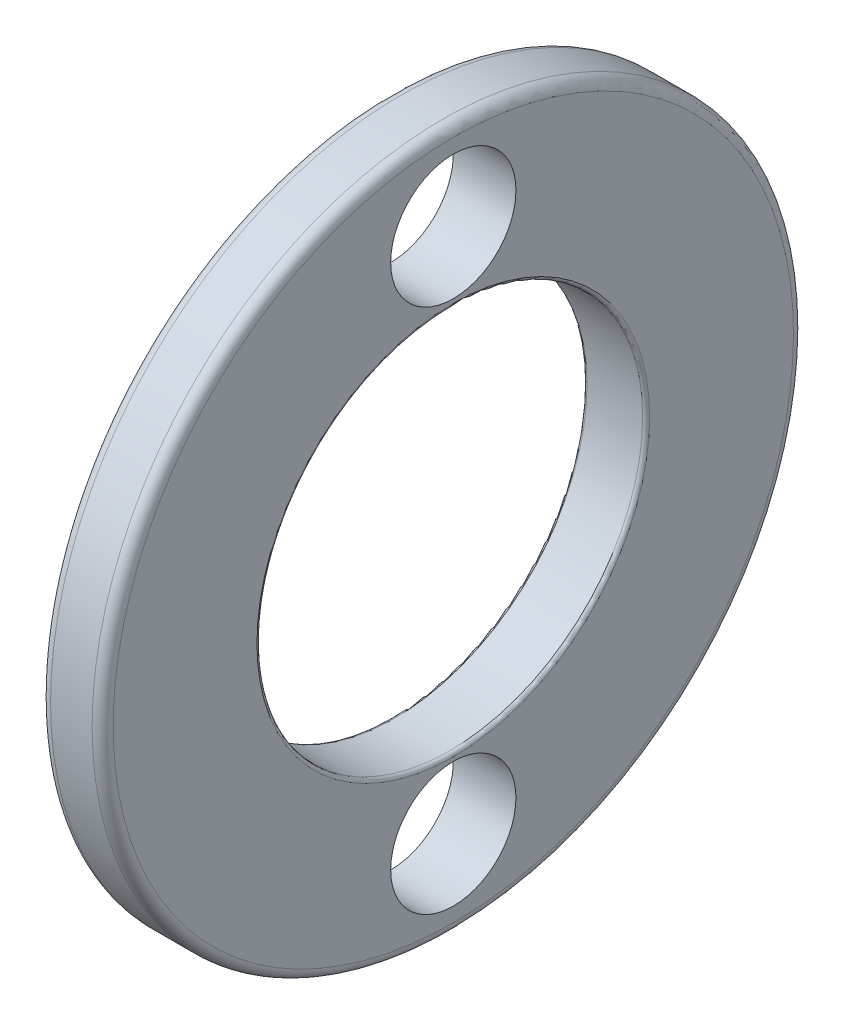
ISO-10303-21;
HEADER;
FILE_DESCRIPTION(('STEP AP214'),'2;1');
FILE_NAME('part.step','',(''),(''),'','','');
FILE_SCHEMA(('AUTOMOTIVE_DESIGN { 1 0 10303 214 1 1 1 1 }'));
ENDSEC;
DATA;
#1=APPLICATION_CONTEXT('core data for automotive mechanical design processes');
#2=APPLICATION_PROTOCOL_DEFINITION('international standard','automotive_design',2000,#1);
#3=PRODUCT_CONTEXT('',#1,'mechanical');
#4=PRODUCT('Part','Part','',(#3));
#5=PRODUCT_RELATED_PRODUCT_CATEGORY('part','',(#4));
#6=PRODUCT_DEFINITION_FORMATION('','',#4);
#7=PRODUCT_DEFINITION_CONTEXT('part definition',#1,'design');
#8=PRODUCT_DEFINITION('design','',#6,#7);
#9=PRODUCT_DEFINITION_SHAPE('','',#8);
#10=(LENGTH_UNIT() NAMED_UNIT(*) SI_UNIT(.MILLI.,.METRE.));
#11=(NAMED_UNIT(*) PLANE_ANGLE_UNIT() SI_UNIT($,.RADIAN.));
#12=(NAMED_UNIT(*) SI_UNIT($,.STERADIAN.) SOLID_ANGLE_UNIT());
#13=UNCERTAINTY_MEASURE_WITH_UNIT(LENGTH_MEASURE(1.E-05),#10,'distance_accuracy_value','');
#14=(GEOMETRIC_REPRESENTATION_CONTEXT(3) GLOBAL_UNCERTAINTY_ASSIGNED_CONTEXT((#13)) GLOBAL_UNIT_ASSIGNED_CONTEXT((#10,
#11,#12)) REPRESENTATION_CONTEXT('',''));
#15=CARTESIAN_POINT('',(0.,0.,0.));
#16=DIRECTION('',(0.,0.,1.));
#17=DIRECTION('',(1.,0.,0.));
#18=AXIS2_PLACEMENT_3D('',#15,#16,#17);
#19=CARTESIAN_POINT('',(5.214,19.4,0.));
#20=DIRECTION('',(-1.,0.,0.));
#21=DIRECTION('',(0.,0.,1.));
#22=AXIS2_PLACEMENT_3D('',#19,#20,#21);
#23=PLANE('',#22);
#24=CARTESIAN_POINT('',(5.214,15.,0.));
#25=DIRECTION('',(-1.,0.,0.));
#26=DIRECTION('',(0.,0.,1.));
#27=AXIS2_PLACEMENT_3D('',#24,#25,#26);
#28=CIRCLE('',#27,3.572);
#29=CARTESIAN_POINT('',(5.214,15.,3.572));
#30=VERTEX_POINT('',#29);
#31=EDGE_CURVE('E47',#30,#30,#28,.F.);
#32=ORIENTED_EDGE('',*,*,#31,.T.);
#33=EDGE_LOOP('',(#32));
#34=FACE_BOUND('',#33,.T.);
#35=CARTESIAN_POINT('',(5.214,0.,0.));
#36=DIRECTION('',(1.,0.,0.));
#37=DIRECTION('',(0.,0.,-1.));
#38=AXIS2_PLACEMENT_3D('',#35,#36,#37);
#39=CIRCLE('',#38,11.2);
#40=CARTESIAN_POINT('',(5.214,0.,-11.2));
#41=VERTEX_POINT('',#40);
#42=EDGE_CURVE('E37',#41,#41,#39,.T.);
#43=ORIENTED_EDGE('',*,*,#42,.T.);
#44=EDGE_LOOP('',(#43));
#45=FACE_BOUND('',#44,.T.);
#46=CARTESIAN_POINT('',(5.214,0.,0.));
#47=DIRECTION('',(1.,0.,0.));
#48=DIRECTION('',(0.,0.,-1.));
#49=AXIS2_PLACEMENT_3D('',#46,#47,#48);
#50=CIRCLE('',#49,19.4);
#51=CARTESIAN_POINT('',(5.214,0.,-19.4));
#52=VERTEX_POINT('',#51);
#53=EDGE_CURVE('E10',#52,#52,#50,.T.);
#54=ORIENTED_EDGE('',*,*,#53,.F.);
#55=EDGE_LOOP('',(#54));
#56=FACE_BOUND('',#55,.T.);
#57=CARTESIAN_POINT('',(5.214,-15.,0.));
#58=DIRECTION('',(-1.,0.,0.));
#59=DIRECTION('',(0.,0.,1.));
#60=AXIS2_PLACEMENT_3D('',#57,#58,#59);
#61=CIRCLE('',#60,3.572);
#62=CARTESIAN_POINT('',(5.214,-15.,3.572));
#63=VERTEX_POINT('',#62);
#64=EDGE_CURVE('E48',#63,#63,#61,.F.);
#65=ORIENTED_EDGE('',*,*,#64,.T.);
#66=EDGE_LOOP('',(#65));
#67=FACE_BOUND('',#66,.T.);
#68=ADVANCED_FACE('F29',(#34,#45,#56,#67),#23,.T.);
#69=CARTESIAN_POINT('',(8.786,11.2,0.));
#70=DIRECTION('',(1.,0.,0.));
#71=DIRECTION('',(0.,0.,-1.));
#72=AXIS2_PLACEMENT_3D('',#69,#70,#71);
#73=PLANE('',#72);
#74=CARTESIAN_POINT('',(8.786,15.,0.));
#75=DIRECTION('',(1.,0.,0.));
#76=DIRECTION('',(0.,0.,-1.));
#77=AXIS2_PLACEMENT_3D('',#74,#75,#76);
#78=CIRCLE('',#77,3.572);
#79=CARTESIAN_POINT('',(8.786,15.,-3.572));
#80=VERTEX_POINT('',#79);
#81=EDGE_CURVE('E45',#80,#80,#78,.F.);
#82=ORIENTED_EDGE('',*,*,#81,.T.);
#83=EDGE_LOOP('',(#82));
#84=FACE_BOUND('',#83,.T.);
#85=CARTESIAN_POINT('',(8.786,0.,0.));
#86=DIRECTION('',(1.,0.,0.));
#87=DIRECTION('',(0.,0.,-1.));
#88=AXIS2_PLACEMENT_3D('',#85,#86,#87);
#89=CIRCLE('',#88,19.4);
#90=CARTESIAN_POINT('',(8.786,0.,-19.4));
#91=VERTEX_POINT('',#90);
#92=EDGE_CURVE('E65',#91,#91,#89,.T.);
#93=ORIENTED_EDGE('',*,*,#92,.T.);
#94=EDGE_LOOP('',(#93));
#95=FACE_BOUND('',#94,.T.);
#96=CARTESIAN_POINT('',(8.786,0.,0.));
#97=DIRECTION('',(1.,0.,0.));
#98=DIRECTION('',(0.,0.,-1.));
#99=AXIS2_PLACEMENT_3D('',#96,#97,#98);
#100=CIRCLE('',#99,11.2);
#101=CARTESIAN_POINT('',(8.786,0.,-11.2));
#102=VERTEX_POINT('',#101);
#103=EDGE_CURVE('E68',#102,#102,#100,.T.);
#104=ORIENTED_EDGE('',*,*,#103,.F.);
#105=EDGE_LOOP('',(#104));
#106=FACE_BOUND('',#105,.T.);
#107=CARTESIAN_POINT('',(8.786,-15.,0.));
#108=DIRECTION('',(1.,0.,0.));
#109=DIRECTION('',(0.,0.,-1.));
#110=AXIS2_PLACEMENT_3D('',#107,#108,#109);
#111=CIRCLE('',#110,3.572);
#112=CARTESIAN_POINT('',(8.786,-15.,-3.572));
#113=VERTEX_POINT('',#112);
#114=EDGE_CURVE('E33',#113,#113,#111,.F.);
#115=ORIENTED_EDGE('',*,*,#114,.T.);
#116=EDGE_LOOP('',(#115));
#117=FACE_BOUND('',#116,.T.);
#118=ADVANCED_FACE('F93',(#84,#95,#106,#117),#73,.T.);
#119=CARTESIAN_POINT('',(5.81399999999993,0.,0.));
#120=DIRECTION('',(1.,0.,0.));
#121=DIRECTION('',(0.,0.,-1.));
#122=AXIS2_PLACEMENT_3D('',#119,#120,#121);
#123=TOROIDAL_SURFACE('',#122,19.4000000000001,0.599999999999927);
#124=ORIENTED_EDGE('',*,*,#53,.T.);
#125=EDGE_LOOP('',(#124));
#126=FACE_BOUND('',#125,.T.);
#127=CARTESIAN_POINT('',(5.814,0.,0.));
#128=DIRECTION('',(1.,0.,0.));
#129=DIRECTION('',(0.,0.,-1.));
#130=AXIS2_PLACEMENT_3D('',#127,#128,#129);
#131=CIRCLE('',#130,20.);
#132=CARTESIAN_POINT('',(5.814,0.,-20.));
#133=VERTEX_POINT('',#132);
#134=EDGE_CURVE('E52',#133,#133,#131,.T.);
#135=ORIENTED_EDGE('',*,*,#134,.F.);
#136=EDGE_LOOP('',(#135));
#137=FACE_BOUND('',#136,.T.);
#138=ADVANCED_FACE('F31',(#126,#137),#123,.T.);
#139=CARTESIAN_POINT('',(5.41400000000055,0.,0.));
#140=DIRECTION('',(1.,0.,0.));
#141=DIRECTION('',(0.,0.,-1.));
#142=AXIS2_PLACEMENT_3D('',#139,#140,#141);
#143=TOROIDAL_SURFACE('',#142,11.2000000000005,0.200000000000551);
#144=CARTESIAN_POINT('',(5.414,0.,0.));
#145=DIRECTION('',(1.,0.,0.));
#146=DIRECTION('',(0.,0.,-1.));
#147=AXIS2_PLACEMENT_3D('',#144,#145,#146);
#148=CIRCLE('',#147,11.);
#149=CARTESIAN_POINT('',(5.414,0.,-11.));
#150=VERTEX_POINT('',#149);
#151=EDGE_CURVE('E42',#150,#150,#148,.T.);
#152=ORIENTED_EDGE('',*,*,#151,.T.);
#153=EDGE_LOOP('',(#152));
#154=FACE_BOUND('',#153,.T.);
#155=ORIENTED_EDGE('',*,*,#42,.F.);
#156=EDGE_LOOP('',(#155));
#157=FACE_BOUND('',#156,.T.);
#158=ADVANCED_FACE('F76',(#154,#157),#143,.T.);
#159=CARTESIAN_POINT('',(50.,0.,0.));
#160=DIRECTION('',(1.,0.,0.));
#161=DIRECTION('',(0.,0.,-1.));
#162=AXIS2_PLACEMENT_3D('',#159,#160,#161);
#163=CYLINDRICAL_SURFACE('',#162,11.);
#164=CARTESIAN_POINT('',(8.586,0.,0.));
#165=DIRECTION('',(1.,0.,0.));
#166=DIRECTION('',(0.,0.,-1.));
#167=AXIS2_PLACEMENT_3D('',#164,#165,#166);
#168=CIRCLE('',#167,11.);
#169=CARTESIAN_POINT('',(8.586,0.,-11.));
#170=VERTEX_POINT('',#169);
#171=EDGE_CURVE('E71',#170,#170,#168,.T.);
#172=ORIENTED_EDGE('',*,*,#171,.T.);
#173=EDGE_LOOP('',(#172));
#174=FACE_BOUND('',#173,.T.);
#175=ORIENTED_EDGE('',*,*,#151,.F.);
#176=EDGE_LOOP('',(#175));
#177=FACE_BOUND('',#176,.T.);
#178=ADVANCED_FACE('F79',(#174,#177),#163,.F.);
#179=CARTESIAN_POINT('',(8.58599999999945,0.,0.));
#180=DIRECTION('',(1.,0.,0.));
#181=DIRECTION('',(0.,0.,-1.));
#182=AXIS2_PLACEMENT_3D('',#179,#180,#181);
#183=TOROIDAL_SURFACE('',#182,11.2000000000005,0.200000000000548);
#184=ORIENTED_EDGE('',*,*,#103,.T.);
#185=EDGE_LOOP('',(#184));
#186=FACE_BOUND('',#185,.T.);
#187=ORIENTED_EDGE('',*,*,#171,.F.);
#188=EDGE_LOOP('',(#187));
#189=FACE_BOUND('',#188,.T.);
#190=ADVANCED_FACE('F81',(#186,#189),#183,.T.);
#191=CARTESIAN_POINT('',(8.18600000000007,0.,0.));
#192=DIRECTION('',(1.,0.,0.));
#193=DIRECTION('',(0.,0.,-1.));
#194=AXIS2_PLACEMENT_3D('',#191,#192,#193);
#195=TOROIDAL_SURFACE('',#194,19.4000000000001,0.599999999999928);
#196=CARTESIAN_POINT('',(8.186,0.,0.));
#197=DIRECTION('',(1.,0.,0.));
#198=DIRECTION('',(0.,0.,-1.));
#199=AXIS2_PLACEMENT_3D('',#196,#197,#198);
#200=CIRCLE('',#199,20.);
#201=CARTESIAN_POINT('',(8.186,0.,-20.));
#202=VERTEX_POINT('',#201);
#203=EDGE_CURVE('E62',#202,#202,#200,.T.);
#204=ORIENTED_EDGE('',*,*,#203,.T.);
#205=EDGE_LOOP('',(#204));
#206=FACE_BOUND('',#205,.T.);
#207=ORIENTED_EDGE('',*,*,#92,.F.);
#208=EDGE_LOOP('',(#207));
#209=FACE_BOUND('',#208,.T.);
#210=ADVANCED_FACE('F88',(#206,#209),#195,.T.);
#211=CARTESIAN_POINT('',(50.,0.,0.));
#212=DIRECTION('',(1.,0.,0.));
#213=DIRECTION('',(0.,0.,-1.));
#214=AXIS2_PLACEMENT_3D('',#211,#212,#213);
#215=CYLINDRICAL_SURFACE('',#214,20.);
#216=ORIENTED_EDGE('',*,*,#134,.T.);
#217=EDGE_LOOP('',(#216));
#218=FACE_BOUND('',#217,.T.);
#219=ORIENTED_EDGE('',*,*,#203,.F.);
#220=EDGE_LOOP('',(#219));
#221=FACE_BOUND('',#220,.T.);
#222=ADVANCED_FACE('F108',(#218,#221),#215,.T.);
#223=CARTESIAN_POINT('',(12.358,15.,0.));
#224=DIRECTION('',(-1.,0.,0.));
#225=DIRECTION('',(0.,0.,1.));
#226=AXIS2_PLACEMENT_3D('',#223,#224,#225);
#227=CYLINDRICAL_SURFACE('',#226,3.572);
#228=ORIENTED_EDGE('',*,*,#31,.F.);
#229=EDGE_LOOP('',(#228));
#230=FACE_BOUND('',#229,.T.);
#231=ORIENTED_EDGE('',*,*,#81,.F.);
#232=EDGE_LOOP('',(#231));
#233=FACE_BOUND('',#232,.T.);
#234=ADVANCED_FACE('F104',(#230,#233),#227,.F.);
#235=CARTESIAN_POINT('',(12.358,-15.,0.));
#236=DIRECTION('',(-1.,0.,0.));
#237=DIRECTION('',(0.,0.,1.));
#238=AXIS2_PLACEMENT_3D('',#235,#236,#237);
#239=CYLINDRICAL_SURFACE('',#238,3.572);
#240=ORIENTED_EDGE('',*,*,#64,.F.);
#241=EDGE_LOOP('',(#240));
#242=FACE_BOUND('',#241,.T.);
#243=ORIENTED_EDGE('',*,*,#114,.F.);
#244=EDGE_LOOP('',(#243));
#245=FACE_BOUND('',#244,.T.);
#246=ADVANCED_FACE('F107',(#242,#245),#239,.F.);
#247=CLOSED_SHELL('',(#68,#118,#138,#158,#178,#190,#210,#222,#234,#246));
#248=MANIFOLD_SOLID_BREP('B2',#247);
#249=ADVANCED_BREP_SHAPE_REPRESENTATION('',(#18,#248),#14);
#250=SHAPE_DEFINITION_REPRESENTATION(#9,#249);
ENDSEC;
END-ISO-10303-21;
